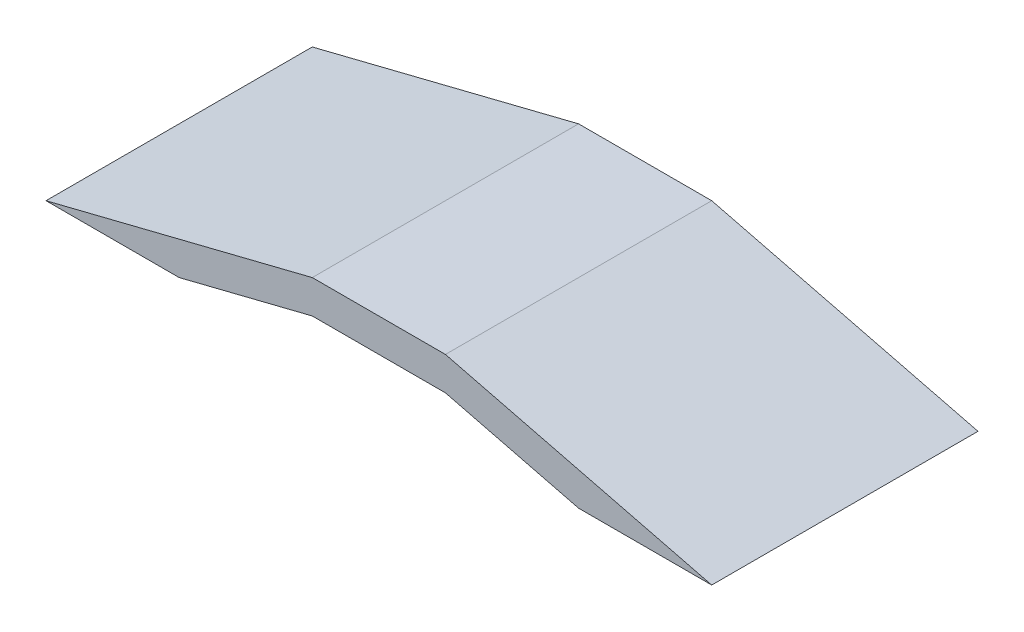
ISO-10303-21;
HEADER;
FILE_DESCRIPTION(('STEP AP214'),'2;1');
FILE_NAME('part.step','',(''),(''),'','','');
FILE_SCHEMA(('AUTOMOTIVE_DESIGN { 1 0 10303 214 1 1 1 1 }'));
ENDSEC;
DATA;
#1=APPLICATION_CONTEXT('core data for automotive mechanical design processes');
#2=APPLICATION_PROTOCOL_DEFINITION('international standard','automotive_design',2000,#1);
#3=PRODUCT_CONTEXT('',#1,'mechanical');
#4=PRODUCT('Part','Part','',(#3));
#5=PRODUCT_RELATED_PRODUCT_CATEGORY('part','',(#4));
#6=PRODUCT_DEFINITION_FORMATION('','',#4);
#7=PRODUCT_DEFINITION_CONTEXT('part definition',#1,'design');
#8=PRODUCT_DEFINITION('design','',#6,#7);
#9=PRODUCT_DEFINITION_SHAPE('','',#8);
#10=(LENGTH_UNIT() NAMED_UNIT(*) SI_UNIT(.MILLI.,.METRE.));
#11=(NAMED_UNIT(*) PLANE_ANGLE_UNIT() SI_UNIT($,.RADIAN.));
#12=(NAMED_UNIT(*) SI_UNIT($,.STERADIAN.) SOLID_ANGLE_UNIT());
#13=UNCERTAINTY_MEASURE_WITH_UNIT(LENGTH_MEASURE(1.E-05),#10,'distance_accuracy_value','');
#14=(GEOMETRIC_REPRESENTATION_CONTEXT(3) GLOBAL_UNCERTAINTY_ASSIGNED_CONTEXT((#13)) GLOBAL_UNIT_ASSIGNED_CONTEXT((#10,
#11,#12)) REPRESENTATION_CONTEXT('',''));
#15=CARTESIAN_POINT('',(0.,0.,0.));
#16=DIRECTION('',(0.,0.,1.));
#17=DIRECTION('',(1.,0.,0.));
#18=AXIS2_PLACEMENT_3D('',#15,#16,#17);
#19=CARTESIAN_POINT('',(0.,0.,-2000.));
#20=DIRECTION('',(0.,1.,0.));
#21=DIRECTION('',(-1.,0.,0.));
#22=AXIS2_PLACEMENT_3D('',#19,#20,#21);
#23=PLANE('',#22);
#24=DIRECTION('',(-1.,0.,0.));
#25=VECTOR('',#24,1.);
#26=CARTESIAN_POINT('',(0.,0.,0.));
#27=LINE('',#26,#25);
#28=CARTESIAN_POINT('',(-2000.,6.99610579116832E-13,0.));
#29=VERTEX_POINT('',#28);
#30=CARTESIAN_POINT('',(-3000.,1.01636428834097E-12,0.));
#31=VERTEX_POINT('',#30);
#32=EDGE_CURVE('E132',#29,#31,#27,.T.);
#33=ORIENTED_EDGE('',*,*,#32,.T.);
#34=DIRECTION('',(0.,0.,1.));
#35=VECTOR('',#34,1.);
#36=CARTESIAN_POINT('',(-3000.,1.01636428834097E-12,-2000.));
#37=LINE('',#36,#35);
#38=CARTESIAN_POINT('',(-3000.,1.01636428834097E-12,-2000.));
#39=VERTEX_POINT('',#38);
#40=EDGE_CURVE('E11',#39,#31,#37,.T.);
#41=ORIENTED_EDGE('',*,*,#40,.F.);
#42=DIRECTION('',(-1.,0.,0.));
#43=VECTOR('',#42,1.);
#44=CARTESIAN_POINT('',(0.,0.,-2000.));
#45=LINE('',#44,#43);
#46=CARTESIAN_POINT('',(-2000.,6.99610579116832E-13,-2000.));
#47=VERTEX_POINT('',#46);
#48=EDGE_CURVE('E150',#47,#39,#45,.T.);
#49=ORIENTED_EDGE('',*,*,#48,.F.);
#50=DIRECTION('',(0.,0.,1.));
#51=VECTOR('',#50,1.);
#52=CARTESIAN_POINT('',(-2000.,6.99610579116832E-13,-2000.));
#53=LINE('',#52,#51);
#54=EDGE_CURVE('E38',#47,#29,#53,.T.);
#55=ORIENTED_EDGE('',*,*,#54,.T.);
#56=EDGE_LOOP('',(#33,#41,#49,#55));
#57=FACE_BOUND('',#56,.T.);
#58=ADVANCED_FACE('F35',(#57),#23,.F.);
#59=CARTESIAN_POINT('',(-176.470588235294,705.882352941176,-2000.));
#60=DIRECTION('',(0.242535625036333,-0.970142500145332,0.));
#61=DIRECTION('',(0.970142500145332,0.242535625036333,0.));
#62=AXIS2_PLACEMENT_3D('',#59,#60,#61);
#63=PLANE('',#62);
#64=DIRECTION('',(0.970142500145332,0.242535625036333,0.));
#65=VECTOR('',#64,1.);
#66=CARTESIAN_POINT('',(-176.470588235294,705.882352941176,0.));
#67=LINE('',#66,#65);
#68=CARTESIAN_POINT('',(-1000.,500.,0.));
#69=VERTEX_POINT('',#68);
#70=EDGE_CURVE('E86',#31,#69,#67,.T.);
#71=ORIENTED_EDGE('',*,*,#70,.T.);
#72=DIRECTION('',(0.,0.,1.));
#73=VECTOR('',#72,1.);
#74=CARTESIAN_POINT('',(-1000.,500.,-2000.));
#75=LINE('',#74,#73);
#76=CARTESIAN_POINT('',(-1000.,500.,-2000.));
#77=VERTEX_POINT('',#76);
#78=EDGE_CURVE('E44',#77,#69,#75,.T.);
#79=ORIENTED_EDGE('',*,*,#78,.F.);
#80=DIRECTION('',(0.970142500145332,0.242535625036333,0.));
#81=VECTOR('',#80,1.);
#82=CARTESIAN_POINT('',(-176.470588235294,705.882352941176,-2000.));
#83=LINE('',#82,#81);
#84=EDGE_CURVE('E52',#39,#77,#83,.T.);
#85=ORIENTED_EDGE('',*,*,#84,.F.);
#86=ORIENTED_EDGE('',*,*,#40,.T.);
#87=EDGE_LOOP('',(#71,#79,#85,#86));
#88=FACE_BOUND('',#87,.T.);
#89=ADVANCED_FACE('F175',(#88),#63,.F.);
#90=CARTESIAN_POINT('',(0.,500.,-2000.));
#91=DIRECTION('',(0.,1.,0.));
#92=DIRECTION('',(-1.,0.,0.));
#93=AXIS2_PLACEMENT_3D('',#90,#91,#92);
#94=PLANE('',#93);
#95=DIRECTION('',(-1.,0.,0.));
#96=VECTOR('',#95,1.);
#97=CARTESIAN_POINT('',(0.,500.,0.));
#98=LINE('',#97,#96);
#99=CARTESIAN_POINT('',(0.,500.,0.));
#100=VERTEX_POINT('',#99);
#101=EDGE_CURVE('E110',#100,#69,#98,.T.);
#102=ORIENTED_EDGE('',*,*,#101,.F.);
#103=DIRECTION('',(0.,0.,1.));
#104=VECTOR('',#103,1.);
#105=CARTESIAN_POINT('',(0.,500.,-2000.));
#106=LINE('',#105,#104);
#107=CARTESIAN_POINT('',(0.,500.,-2000.));
#108=VERTEX_POINT('',#107);
#109=EDGE_CURVE('E106',#108,#100,#106,.T.);
#110=ORIENTED_EDGE('',*,*,#109,.F.);
#111=DIRECTION('',(-1.,0.,0.));
#112=VECTOR('',#111,1.);
#113=CARTESIAN_POINT('',(0.,500.,-2000.));
#114=LINE('',#113,#112);
#115=EDGE_CURVE('E109',#108,#77,#114,.T.);
#116=ORIENTED_EDGE('',*,*,#115,.T.);
#117=ORIENTED_EDGE('',*,*,#78,.T.);
#118=EDGE_LOOP('',(#102,#110,#116,#117));
#119=FACE_BOUND('',#118,.T.);
#120=ADVANCED_FACE('F108',(#119),#94,.T.);
#121=CARTESIAN_POINT('',(117.647058823529,470.588235294118,-2000.));
#122=DIRECTION('',(0.242535625036333,0.970142500145332,0.));
#123=DIRECTION('',(-0.970142500145332,0.242535625036333,0.));
#124=AXIS2_PLACEMENT_3D('',#121,#122,#123);
#125=PLANE('',#124);
#126=DIRECTION('',(-0.970142500145332,0.242535625036333,0.));
#127=VECTOR('',#126,1.);
#128=CARTESIAN_POINT('',(117.647058823529,470.588235294118,0.));
#129=LINE('',#128,#127);
#130=CARTESIAN_POINT('',(2000.,0.,0.));
#131=VERTEX_POINT('',#130);
#132=EDGE_CURVE('E147',#131,#100,#129,.T.);
#133=ORIENTED_EDGE('',*,*,#132,.F.);
#134=DIRECTION('',(0.,0.,1.));
#135=VECTOR('',#134,1.);
#136=CARTESIAN_POINT('',(2000.,0.,-2000.));
#137=LINE('',#136,#135);
#138=CARTESIAN_POINT('',(2000.,0.,-2000.));
#139=VERTEX_POINT('',#138);
#140=EDGE_CURVE('E115',#139,#131,#137,.T.);
#141=ORIENTED_EDGE('',*,*,#140,.F.);
#142=DIRECTION('',(-0.970142500145332,0.242535625036333,0.));
#143=VECTOR('',#142,1.);
#144=CARTESIAN_POINT('',(117.647058823529,470.588235294118,-2000.));
#145=LINE('',#144,#143);
#146=EDGE_CURVE('E121',#139,#108,#145,.T.);
#147=ORIENTED_EDGE('',*,*,#146,.T.);
#148=ORIENTED_EDGE('',*,*,#109,.T.);
#149=EDGE_LOOP('',(#133,#141,#147,#148));
#150=FACE_BOUND('',#149,.T.);
#151=ADVANCED_FACE('F124',(#150),#125,.T.);
#152=CARTESIAN_POINT('',(0.,0.,-2000.));
#153=DIRECTION('',(0.,-1.,0.));
#154=DIRECTION('',(0.,0.,-1.));
#155=AXIS2_PLACEMENT_3D('',#152,#153,#154);
#156=PLANE('',#155);
#157=DIRECTION('',(1.,0.,0.));
#158=VECTOR('',#157,1.);
#159=CARTESIAN_POINT('',(0.,0.,0.));
#160=LINE('',#159,#158);
#161=CARTESIAN_POINT('',(1000.,0.,0.));
#162=VERTEX_POINT('',#161);
#163=EDGE_CURVE('E144',#162,#131,#160,.T.);
#164=ORIENTED_EDGE('',*,*,#163,.F.);
#165=DIRECTION('',(0.,0.,1.));
#166=VECTOR('',#165,1.);
#167=CARTESIAN_POINT('',(1000.,0.,-2000.));
#168=LINE('',#167,#166);
#169=CARTESIAN_POINT('',(1000.,0.,-2000.));
#170=VERTEX_POINT('',#169);
#171=EDGE_CURVE('E154',#170,#162,#168,.T.);
#172=ORIENTED_EDGE('',*,*,#171,.F.);
#173=DIRECTION('',(1.,0.,0.));
#174=VECTOR('',#173,1.);
#175=CARTESIAN_POINT('',(0.,0.,-2000.));
#176=LINE('',#175,#174);
#177=EDGE_CURVE('E125',#170,#139,#176,.T.);
#178=ORIENTED_EDGE('',*,*,#177,.T.);
#179=ORIENTED_EDGE('',*,*,#140,.T.);
#180=EDGE_LOOP('',(#164,#172,#178,#179));
#181=FACE_BOUND('',#180,.T.);
#182=ADVANCED_FACE('F188',(#181),#156,.T.);
#183=CARTESIAN_POINT('',(58.8235294117647,235.294117647059,-2000.));
#184=DIRECTION('',(-0.242535625036333,-0.970142500145332,0.));
#185=DIRECTION('',(0.970142500145332,-0.242535625036333,0.));
#186=AXIS2_PLACEMENT_3D('',#183,#184,#185);
#187=PLANE('',#186);
#188=DIRECTION('',(0.970142500145332,-0.242535625036333,0.));
#189=VECTOR('',#188,1.);
#190=CARTESIAN_POINT('',(58.8235294117647,235.294117647059,0.));
#191=LINE('',#190,#189);
#192=CARTESIAN_POINT('',(0.,250.,0.));
#193=VERTEX_POINT('',#192);
#194=EDGE_CURVE('E141',#193,#162,#191,.T.);
#195=ORIENTED_EDGE('',*,*,#194,.F.);
#196=DIRECTION('',(0.,0.,1.));
#197=VECTOR('',#196,1.);
#198=CARTESIAN_POINT('',(0.,250.,-2000.));
#199=LINE('',#198,#197);
#200=CARTESIAN_POINT('',(0.,250.,-2000.));
#201=VERTEX_POINT('',#200);
#202=EDGE_CURVE('E156',#201,#193,#199,.T.);
#203=ORIENTED_EDGE('',*,*,#202,.F.);
#204=DIRECTION('',(0.970142500145332,-0.242535625036333,0.));
#205=VECTOR('',#204,1.);
#206=CARTESIAN_POINT('',(58.8235294117647,235.294117647059,-2000.));
#207=LINE('',#206,#205);
#208=EDGE_CURVE('E127',#201,#170,#207,.T.);
#209=ORIENTED_EDGE('',*,*,#208,.T.);
#210=ORIENTED_EDGE('',*,*,#171,.T.);
#211=EDGE_LOOP('',(#195,#203,#209,#210));
#212=FACE_BOUND('',#211,.T.);
#213=ADVANCED_FACE('F171',(#212),#187,.T.);
#214=CARTESIAN_POINT('',(0.,250.,-2000.));
#215=DIRECTION('',(0.,-1.,0.));
#216=DIRECTION('',(1.,0.,0.));
#217=AXIS2_PLACEMENT_3D('',#214,#215,#216);
#218=PLANE('',#217);
#219=DIRECTION('',(1.,0.,0.));
#220=VECTOR('',#219,1.);
#221=CARTESIAN_POINT('',(0.,250.,0.));
#222=LINE('',#221,#220);
#223=CARTESIAN_POINT('',(-1000.,250.,0.));
#224=VERTEX_POINT('',#223);
#225=EDGE_CURVE('E138',#224,#193,#222,.T.);
#226=ORIENTED_EDGE('',*,*,#225,.F.);
#227=DIRECTION('',(0.,0.,1.));
#228=VECTOR('',#227,1.);
#229=CARTESIAN_POINT('',(-1000.,250.,-2000.));
#230=LINE('',#229,#228);
#231=CARTESIAN_POINT('',(-1000.,250.,-2000.));
#232=VERTEX_POINT('',#231);
#233=EDGE_CURVE('E157',#232,#224,#230,.T.);
#234=ORIENTED_EDGE('',*,*,#233,.F.);
#235=DIRECTION('',(1.,0.,0.));
#236=VECTOR('',#235,1.);
#237=CARTESIAN_POINT('',(0.,250.,-2000.));
#238=LINE('',#237,#236);
#239=EDGE_CURVE('E202',#232,#201,#238,.T.);
#240=ORIENTED_EDGE('',*,*,#239,.T.);
#241=ORIENTED_EDGE('',*,*,#202,.T.);
#242=EDGE_LOOP('',(#226,#234,#240,#241));
#243=FACE_BOUND('',#242,.T.);
#244=ADVANCED_FACE('F165',(#243),#218,.T.);
#245=CARTESIAN_POINT('',(-117.647058823529,470.588235294117,-2000.));
#246=DIRECTION('',(0.242535625036333,-0.970142500145332,0.));
#247=DIRECTION('',(0.970142500145332,0.242535625036333,0.));
#248=AXIS2_PLACEMENT_3D('',#245,#246,#247);
#249=PLANE('',#248);
#250=DIRECTION('',(0.970142500145332,0.242535625036333,0.));
#251=VECTOR('',#250,1.);
#252=CARTESIAN_POINT('',(-117.647058823529,470.588235294117,0.));
#253=LINE('',#252,#251);
#254=EDGE_CURVE('E135',#29,#224,#253,.T.);
#255=ORIENTED_EDGE('',*,*,#254,.F.);
#256=ORIENTED_EDGE('',*,*,#54,.F.);
#257=DIRECTION('',(0.970142500145332,0.242535625036333,0.));
#258=VECTOR('',#257,1.);
#259=CARTESIAN_POINT('',(-117.647058823529,470.588235294117,-2000.));
#260=LINE('',#259,#258);
#261=EDGE_CURVE('E203',#47,#232,#260,.T.);
#262=ORIENTED_EDGE('',*,*,#261,.T.);
#263=ORIENTED_EDGE('',*,*,#233,.T.);
#264=EDGE_LOOP('',(#255,#256,#262,#263));
#265=FACE_BOUND('',#264,.T.);
#266=ADVANCED_FACE('F163',(#265),#249,.T.);
#267=CARTESIAN_POINT('',(0.,0.,-2000.));
#268=DIRECTION('',(0.,0.,1.));
#269=DIRECTION('',(1.,0.,0.));
#270=AXIS2_PLACEMENT_3D('',#267,#268,#269);
#271=PLANE('',#270);
#272=ORIENTED_EDGE('',*,*,#48,.T.);
#273=ORIENTED_EDGE('',*,*,#84,.T.);
#274=ORIENTED_EDGE('',*,*,#115,.F.);
#275=ORIENTED_EDGE('',*,*,#146,.F.);
#276=ORIENTED_EDGE('',*,*,#177,.F.);
#277=ORIENTED_EDGE('',*,*,#208,.F.);
#278=ORIENTED_EDGE('',*,*,#239,.F.);
#279=ORIENTED_EDGE('',*,*,#261,.F.);
#280=EDGE_LOOP('',(#272,#273,#274,#275,#276,#277,#278,#279));
#281=FACE_BOUND('',#280,.T.);
#282=ADVANCED_FACE('F119',(#281),#271,.F.);
#283=CARTESIAN_POINT('',(0.,0.,0.));
#284=DIRECTION('',(0.,0.,1.));
#285=DIRECTION('',(1.,0.,0.));
#286=AXIS2_PLACEMENT_3D('',#283,#284,#285);
#287=PLANE('',#286);
#288=ORIENTED_EDGE('',*,*,#32,.F.);
#289=ORIENTED_EDGE('',*,*,#254,.T.);
#290=ORIENTED_EDGE('',*,*,#225,.T.);
#291=ORIENTED_EDGE('',*,*,#194,.T.);
#292=ORIENTED_EDGE('',*,*,#163,.T.);
#293=ORIENTED_EDGE('',*,*,#132,.T.);
#294=ORIENTED_EDGE('',*,*,#101,.T.);
#295=ORIENTED_EDGE('',*,*,#70,.F.);
#296=EDGE_LOOP('',(#288,#289,#290,#291,#292,#293,#294,#295));
#297=FACE_BOUND('',#296,.T.);
#298=ADVANCED_FACE('F162',(#297),#287,.T.);
#299=CLOSED_SHELL('',(#58,#89,#120,#151,#182,#213,#244,#266,#282,#298));
#300=MANIFOLD_SOLID_BREP('B2',#299);
#301=ADVANCED_BREP_SHAPE_REPRESENTATION('',(#18,#300),#14);
#302=SHAPE_DEFINITION_REPRESENTATION(#9,#301);
ENDSEC;
END-ISO-10303-21;
